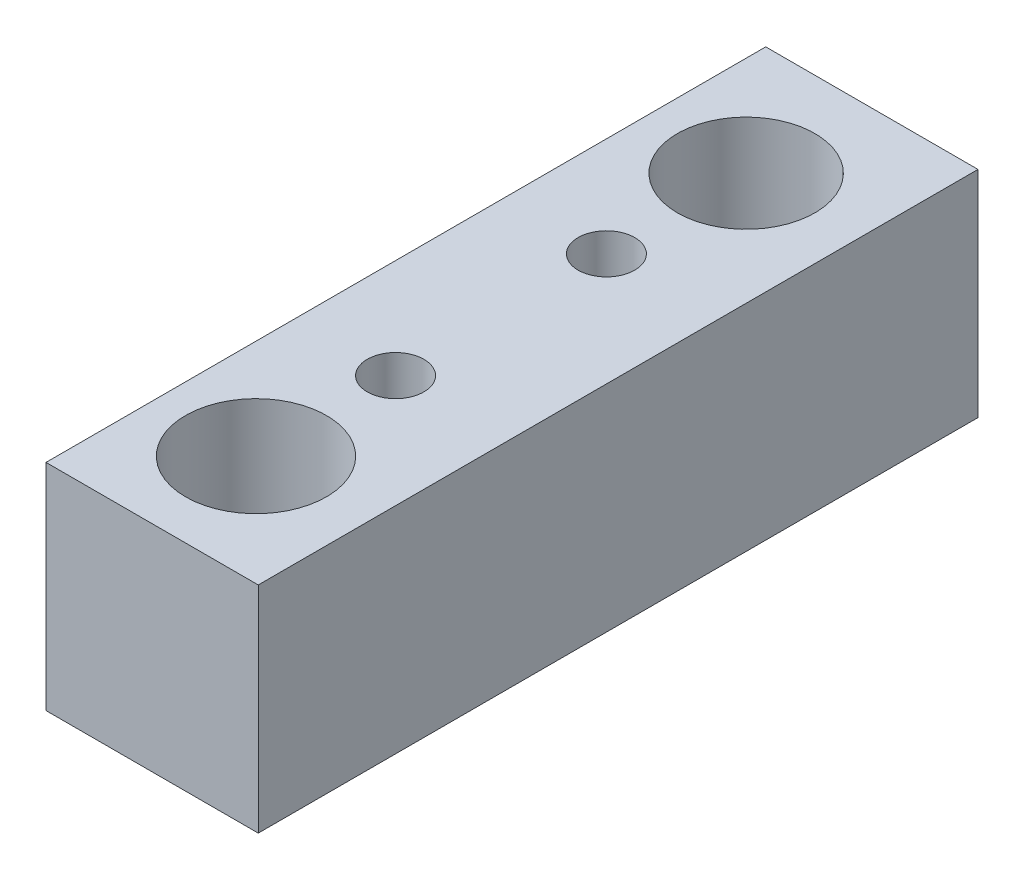
ISO-10303-21;
HEADER;
FILE_DESCRIPTION(('STEP AP214'),'2;1');
FILE_NAME('part.step','',(''),(''),'','','');
FILE_SCHEMA(('AUTOMOTIVE_DESIGN { 1 0 10303 214 1 1 1 1 }'));
ENDSEC;
DATA;
#1=APPLICATION_CONTEXT('core data for automotive mechanical design processes');
#2=APPLICATION_PROTOCOL_DEFINITION('international standard','automotive_design',2000,#1);
#3=PRODUCT_CONTEXT('',#1,'mechanical');
#4=PRODUCT('Part','Part','',(#3));
#5=PRODUCT_RELATED_PRODUCT_CATEGORY('part','',(#4));
#6=PRODUCT_DEFINITION_FORMATION('','',#4);
#7=PRODUCT_DEFINITION_CONTEXT('part definition',#1,'design');
#8=PRODUCT_DEFINITION('design','',#6,#7);
#9=PRODUCT_DEFINITION_SHAPE('','',#8);
#10=(LENGTH_UNIT() NAMED_UNIT(*) SI_UNIT(.MILLI.,.METRE.));
#11=(NAMED_UNIT(*) PLANE_ANGLE_UNIT() SI_UNIT($,.RADIAN.));
#12=(NAMED_UNIT(*) SI_UNIT($,.STERADIAN.) SOLID_ANGLE_UNIT());
#13=UNCERTAINTY_MEASURE_WITH_UNIT(LENGTH_MEASURE(1.E-05),#10,'distance_accuracy_value','');
#14=(GEOMETRIC_REPRESENTATION_CONTEXT(3) GLOBAL_UNCERTAINTY_ASSIGNED_CONTEXT((#13)) GLOBAL_UNIT_ASSIGNED_CONTEXT((#10,
#11,#12)) REPRESENTATION_CONTEXT('',''));
#15=CARTESIAN_POINT('',(0.,0.,0.));
#16=DIRECTION('',(0.,0.,1.));
#17=DIRECTION('',(1.,0.,0.));
#18=AXIS2_PLACEMENT_3D('',#15,#16,#17);
#19=CARTESIAN_POINT('',(60.,28.4200909691457,101.920326234178));
#20=DIRECTION('',(0.,0.,-1.));
#21=DIRECTION('',(-1.,0.,0.));
#22=AXIS2_PLACEMENT_3D('',#19,#20,#21);
#23=PLANE('',#22);
#24=DIRECTION('',(0.,-1.,0.));
#25=VECTOR('',#24,1.);
#26=CARTESIAN_POINT('',(0.,28.4200909691457,101.920326234178));
#27=LINE('',#26,#25);
#28=CARTESIAN_POINT('',(0.,28.4200909691457,101.920326234178));
#29=VERTEX_POINT('',#28);
#30=CARTESIAN_POINT('',(0.,-32.3401035166141,101.920326234178));
#31=VERTEX_POINT('',#30);
#32=EDGE_CURVE('E96',#29,#31,#27,.T.);
#33=ORIENTED_EDGE('',*,*,#32,.T.);
#34=DIRECTION('',(-1.,0.,0.));
#35=VECTOR('',#34,1.);
#36=CARTESIAN_POINT('',(60.,-32.3401035166141,101.920326234178));
#37=LINE('',#36,#35);
#38=CARTESIAN_POINT('',(60.,-32.3401035166141,101.920326234178));
#39=VERTEX_POINT('',#38);
#40=EDGE_CURVE('E11',#39,#31,#37,.T.);
#41=ORIENTED_EDGE('',*,*,#40,.F.);
#42=DIRECTION('',(0.,-1.,0.));
#43=VECTOR('',#42,1.);
#44=CARTESIAN_POINT('',(60.,28.4200909691457,101.920326234178));
#45=LINE('',#44,#43);
#46=CARTESIAN_POINT('',(60.,28.4200909691457,101.920326234178));
#47=VERTEX_POINT('',#46);
#48=EDGE_CURVE('E84',#47,#39,#45,.T.);
#49=ORIENTED_EDGE('',*,*,#48,.F.);
#50=DIRECTION('',(-1.,0.,0.));
#51=VECTOR('',#50,1.);
#52=CARTESIAN_POINT('',(60.,28.4200909691457,101.920326234178));
#53=LINE('',#52,#51);
#54=EDGE_CURVE('E92',#47,#29,#53,.T.);
#55=ORIENTED_EDGE('',*,*,#54,.T.);
#56=EDGE_LOOP('',(#33,#41,#49,#55));
#57=FACE_BOUND('',#56,.T.);
#58=ADVANCED_FACE('F33',(#57),#23,.F.);
#59=CARTESIAN_POINT('',(60.,-32.3401035166141,101.920326234178));
#60=DIRECTION('',(0.,1.,0.));
#61=DIRECTION('',(0.,0.,1.));
#62=AXIS2_PLACEMENT_3D('',#59,#60,#61);
#63=PLANE('',#62);
#64=CARTESIAN_POINT('',(28.1574756542223,-32.3401035166141,70.7138110485273));
#65=DIRECTION('',(0.,1.,0.));
#66=DIRECTION('',(0.,0.,1.));
#67=AXIS2_PLACEMENT_3D('',#64,#65,#66);
#68=CIRCLE('',#67,19.923805807868);
#69=CARTESIAN_POINT('',(28.1574756542223,-32.3401035166141,90.6376168563953));
#70=VERTEX_POINT('',#69);
#71=EDGE_CURVE('E115',#70,#70,#68,.T.);
#72=ORIENTED_EDGE('',*,*,#71,.T.);
#73=EDGE_LOOP('',(#72));
#74=FACE_BOUND('',#73,.T.);
#75=CARTESIAN_POINT('',(28.1574756542223,-32.3401035166141,-67.8353457125255));
#76=DIRECTION('',(0.,1.,0.));
#77=DIRECTION('',(0.,0.,1.));
#78=AXIS2_PLACEMENT_3D('',#75,#76,#77);
#79=CIRCLE('',#78,19.4344971022291);
#80=CARTESIAN_POINT('',(28.1574756542223,-32.3401035166141,-48.4008486102964));
#81=VERTEX_POINT('',#80);
#82=EDGE_CURVE('E99',#81,#81,#79,.T.);
#83=ORIENTED_EDGE('',*,*,#82,.T.);
#84=EDGE_LOOP('',(#83));
#85=FACE_BOUND('',#84,.T.);
#86=DIRECTION('',(0.,0.,-1.));
#87=VECTOR('',#86,1.);
#88=CARTESIAN_POINT('',(0.,-32.3401035166141,101.920326234178));
#89=LINE('',#88,#87);
#90=CARTESIAN_POINT('',(0.,-32.3401035166141,-101.528324979431));
#91=VERTEX_POINT('',#90);
#92=EDGE_CURVE('E88',#31,#91,#89,.T.);
#93=ORIENTED_EDGE('',*,*,#92,.T.);
#94=DIRECTION('',(-1.,0.,0.));
#95=VECTOR('',#94,1.);
#96=CARTESIAN_POINT('',(60.,-32.3401035166141,-101.528324979431));
#97=LINE('',#96,#95);
#98=CARTESIAN_POINT('',(60.,-32.3401035166141,-101.528324979431));
#99=VERTEX_POINT('',#98);
#100=EDGE_CURVE('E41',#99,#91,#97,.T.);
#101=ORIENTED_EDGE('',*,*,#100,.F.);
#102=DIRECTION('',(0.,0.,-1.));
#103=VECTOR('',#102,1.);
#104=CARTESIAN_POINT('',(60.,-32.3401035166141,101.920326234178));
#105=LINE('',#104,#103);
#106=EDGE_CURVE('E79',#39,#99,#105,.T.);
#107=ORIENTED_EDGE('',*,*,#106,.F.);
#108=ORIENTED_EDGE('',*,*,#40,.T.);
#109=EDGE_LOOP('',(#93,#101,#107,#108));
#110=FACE_BOUND('',#109,.T.);
#111=ADVANCED_FACE('F87',(#74,#85,#110),#63,.F.);
#112=CARTESIAN_POINT('',(60.,28.4200909691457,-101.528324979431));
#113=DIRECTION('',(0.,0.,1.));
#114=DIRECTION('',(1.,0.,0.));
#115=AXIS2_PLACEMENT_3D('',#112,#113,#114);
#116=PLANE('',#115);
#117=DIRECTION('',(0.,1.,0.));
#118=VECTOR('',#117,1.);
#119=CARTESIAN_POINT('',(0.,28.4200909691457,-101.528324979431));
#120=LINE('',#119,#118);
#121=CARTESIAN_POINT('',(0.,28.4200909691457,-101.528324979431));
#122=VERTEX_POINT('',#121);
#123=EDGE_CURVE('E66',#91,#122,#120,.T.);
#124=ORIENTED_EDGE('',*,*,#123,.T.);
#125=DIRECTION('',(-1.,0.,0.));
#126=VECTOR('',#125,1.);
#127=CARTESIAN_POINT('',(60.,28.4200909691457,-101.528324979431));
#128=LINE('',#127,#126);
#129=CARTESIAN_POINT('',(60.,28.4200909691457,-101.528324979431));
#130=VERTEX_POINT('',#129);
#131=EDGE_CURVE('E89',#130,#122,#128,.T.);
#132=ORIENTED_EDGE('',*,*,#131,.F.);
#133=DIRECTION('',(0.,1.,0.));
#134=VECTOR('',#133,1.);
#135=CARTESIAN_POINT('',(60.,28.4200909691457,-101.528324979431));
#136=LINE('',#135,#134);
#137=EDGE_CURVE('E82',#99,#130,#136,.T.);
#138=ORIENTED_EDGE('',*,*,#137,.F.);
#139=ORIENTED_EDGE('',*,*,#100,.T.);
#140=EDGE_LOOP('',(#124,#132,#138,#139));
#141=FACE_BOUND('',#140,.T.);
#142=ADVANCED_FACE('F90',(#141),#116,.F.);
#143=CARTESIAN_POINT('',(60.,28.4200909691457,101.920326234178));
#144=DIRECTION('',(0.,-1.,0.));
#145=DIRECTION('',(0.,0.,-1.));
#146=AXIS2_PLACEMENT_3D('',#143,#144,#145);
#147=PLANE('',#146);
#148=CARTESIAN_POINT('',(28.1574756542223,28.4200909691457,31.2660703596712));
#149=DIRECTION('',(0.,1.,0.));
#150=DIRECTION('',(0.,0.,1.));
#151=AXIS2_PLACEMENT_3D('',#148,#149,#150);
#152=CIRCLE('',#151,8.);
#153=CARTESIAN_POINT('',(28.1574756542223,28.4200909691457,39.2660703596712));
#154=VERTEX_POINT('',#153);
#155=EDGE_CURVE('E128',#154,#154,#152,.T.);
#156=ORIENTED_EDGE('',*,*,#155,.F.);
#157=EDGE_LOOP('',(#156));
#158=FACE_BOUND('',#157,.T.);
#159=CARTESIAN_POINT('',(28.1574756542223,28.4200909691457,-28.339432246705));
#160=DIRECTION('',(0.,1.,0.));
#161=DIRECTION('',(0.,0.,1.));
#162=AXIS2_PLACEMENT_3D('',#159,#160,#161);
#163=CIRCLE('',#162,8.);
#164=CARTESIAN_POINT('',(28.1574756542223,28.4200909691457,-20.339432246705));
#165=VERTEX_POINT('',#164);
#166=EDGE_CURVE('E122',#165,#165,#163,.T.);
#167=ORIENTED_EDGE('',*,*,#166,.F.);
#168=EDGE_LOOP('',(#167));
#169=FACE_BOUND('',#168,.T.);
#170=CARTESIAN_POINT('',(28.1574756542223,28.4200909691457,70.7138110485273));
#171=DIRECTION('',(0.,1.,0.));
#172=DIRECTION('',(0.,0.,1.));
#173=AXIS2_PLACEMENT_3D('',#170,#171,#172);
#174=CIRCLE('',#173,19.923805807868);
#175=CARTESIAN_POINT('',(28.1574756542223,28.4200909691457,90.6376168563953));
#176=VERTEX_POINT('',#175);
#177=EDGE_CURVE('E118',#176,#176,#174,.T.);
#178=ORIENTED_EDGE('',*,*,#177,.F.);
#179=EDGE_LOOP('',(#178));
#180=FACE_BOUND('',#179,.T.);
#181=CARTESIAN_POINT('',(28.1574756542223,28.4200909691457,-67.8353457125255));
#182=DIRECTION('',(0.,1.,0.));
#183=DIRECTION('',(0.,0.,1.));
#184=AXIS2_PLACEMENT_3D('',#181,#182,#183);
#185=CIRCLE('',#184,19.4344971022291);
#186=CARTESIAN_POINT('',(28.1574756542223,28.4200909691457,-48.4008486102964));
#187=VERTEX_POINT('',#186);
#188=EDGE_CURVE('E112',#187,#187,#185,.T.);
#189=ORIENTED_EDGE('',*,*,#188,.F.);
#190=EDGE_LOOP('',(#189));
#191=FACE_BOUND('',#190,.T.);
#192=DIRECTION('',(0.,0.,1.));
#193=VECTOR('',#192,1.);
#194=CARTESIAN_POINT('',(0.,28.4200909691457,101.920326234178));
#195=LINE('',#194,#193);
#196=EDGE_CURVE('E72',#122,#29,#195,.T.);
#197=ORIENTED_EDGE('',*,*,#196,.T.);
#198=ORIENTED_EDGE('',*,*,#54,.F.);
#199=DIRECTION('',(0.,0.,1.));
#200=VECTOR('',#199,1.);
#201=CARTESIAN_POINT('',(60.,28.4200909691457,101.920326234178));
#202=LINE('',#201,#200);
#203=EDGE_CURVE('E49',#130,#47,#202,.T.);
#204=ORIENTED_EDGE('',*,*,#203,.F.);
#205=ORIENTED_EDGE('',*,*,#131,.T.);
#206=EDGE_LOOP('',(#197,#198,#204,#205));
#207=FACE_BOUND('',#206,.T.);
#208=ADVANCED_FACE('F104',(#158,#169,#180,#191,#207),#147,.F.);
#209=CARTESIAN_POINT('',(60.,-32.3401035166141,101.920326234178));
#210=DIRECTION('',(1.,0.,0.));
#211=DIRECTION('',(0.,0.,-1.));
#212=AXIS2_PLACEMENT_3D('',#209,#210,#211);
#213=PLANE('',#212);
#214=ORIENTED_EDGE('',*,*,#48,.T.);
#215=ORIENTED_EDGE('',*,*,#106,.T.);
#216=ORIENTED_EDGE('',*,*,#137,.T.);
#217=ORIENTED_EDGE('',*,*,#203,.T.);
#218=EDGE_LOOP('',(#214,#215,#216,#217));
#219=FACE_BOUND('',#218,.T.);
#220=ADVANCED_FACE('F80',(#219),#213,.T.);
#221=CARTESIAN_POINT('',(0.,-32.3401035166141,101.920326234178));
#222=DIRECTION('',(1.,0.,0.));
#223=DIRECTION('',(0.,0.,-1.));
#224=AXIS2_PLACEMENT_3D('',#221,#222,#223);
#225=PLANE('',#224);
#226=ORIENTED_EDGE('',*,*,#32,.F.);
#227=ORIENTED_EDGE('',*,*,#196,.F.);
#228=ORIENTED_EDGE('',*,*,#123,.F.);
#229=ORIENTED_EDGE('',*,*,#92,.F.);
#230=EDGE_LOOP('',(#226,#227,#228,#229));
#231=FACE_BOUND('',#230,.T.);
#232=ADVANCED_FACE('F107',(#231),#225,.F.);
#233=CARTESIAN_POINT('',(28.1574756542223,-51.5799090308543,-67.8353457125255));
#234=DIRECTION('',(0.,1.,0.));
#235=DIRECTION('',(0.,0.,1.));
#236=AXIS2_PLACEMENT_3D('',#233,#234,#235);
#237=CYLINDRICAL_SURFACE('',#236,19.4344971022291);
#238=ORIENTED_EDGE('',*,*,#188,.T.);
#239=EDGE_LOOP('',(#238));
#240=FACE_BOUND('',#239,.T.);
#241=ORIENTED_EDGE('',*,*,#82,.F.);
#242=EDGE_LOOP('',(#241));
#243=FACE_BOUND('',#242,.T.);
#244=ADVANCED_FACE('F152',(#240,#243),#237,.F.);
#245=CARTESIAN_POINT('',(28.1574756542223,-51.5799090308543,70.7138110485273));
#246=DIRECTION('',(0.,1.,0.));
#247=DIRECTION('',(0.,0.,1.));
#248=AXIS2_PLACEMENT_3D('',#245,#246,#247);
#249=CYLINDRICAL_SURFACE('',#248,19.923805807868);
#250=ORIENTED_EDGE('',*,*,#177,.T.);
#251=EDGE_LOOP('',(#250));
#252=FACE_BOUND('',#251,.T.);
#253=ORIENTED_EDGE('',*,*,#71,.F.);
#254=EDGE_LOOP('',(#253));
#255=FACE_BOUND('',#254,.T.);
#256=ADVANCED_FACE('F155',(#252,#255),#249,.F.);
#257=CARTESIAN_POINT('',(28.1574756542223,-16.5799090308543,-28.339432246705));
#258=DIRECTION('',(0.,1.,0.));
#259=DIRECTION('',(0.,0.,1.));
#260=AXIS2_PLACEMENT_3D('',#257,#258,#259);
#261=CYLINDRICAL_SURFACE('',#260,8.);
#262=CARTESIAN_POINT('',(28.1574756542223,-16.5799090308543,-28.339432246705));
#263=DIRECTION('',(0.,1.,0.));
#264=DIRECTION('',(0.,0.,1.));
#265=AXIS2_PLACEMENT_3D('',#262,#263,#264);
#266=CIRCLE('',#265,8.);
#267=CARTESIAN_POINT('',(28.1574756542223,-16.5799090308543,-20.339432246705));
#268=VERTEX_POINT('',#267);
#269=EDGE_CURVE('E121',#268,#268,#266,.T.);
#270=ORIENTED_EDGE('',*,*,#269,.F.);
#271=EDGE_LOOP('',(#270));
#272=FACE_BOUND('',#271,.T.);
#273=ORIENTED_EDGE('',*,*,#166,.T.);
#274=EDGE_LOOP('',(#273));
#275=FACE_BOUND('',#274,.T.);
#276=ADVANCED_FACE('F173',(#272,#275),#261,.F.);
#277=CARTESIAN_POINT('',(28.1574756542223,-16.5799090308543,-28.339432246705));
#278=DIRECTION('',(0.,1.,0.));
#279=DIRECTION('',(0.,0.,1.));
#280=AXIS2_PLACEMENT_3D('',#277,#278,#279);
#281=PLANE('',#280);
#282=ORIENTED_EDGE('',*,*,#269,.T.);
#283=EDGE_LOOP('',(#282));
#284=FACE_BOUND('',#283,.T.);
#285=ADVANCED_FACE('F139',(#284),#281,.T.);
#286=CARTESIAN_POINT('',(28.1574756542223,-16.5799090308543,31.2660703596712));
#287=DIRECTION('',(0.,1.,0.));
#288=DIRECTION('',(0.,0.,1.));
#289=AXIS2_PLACEMENT_3D('',#286,#287,#288);
#290=CYLINDRICAL_SURFACE('',#289,8.);
#291=CARTESIAN_POINT('',(28.1574756542223,-16.5799090308543,31.2660703596712));
#292=DIRECTION('',(0.,1.,0.));
#293=DIRECTION('',(0.,0.,1.));
#294=AXIS2_PLACEMENT_3D('',#291,#292,#293);
#295=CIRCLE('',#294,8.);
#296=CARTESIAN_POINT('',(28.1574756542223,-16.5799090308543,39.2660703596712));
#297=VERTEX_POINT('',#296);
#298=EDGE_CURVE('E125',#297,#297,#295,.T.);
#299=ORIENTED_EDGE('',*,*,#298,.F.);
#300=EDGE_LOOP('',(#299));
#301=FACE_BOUND('',#300,.T.);
#302=ORIENTED_EDGE('',*,*,#155,.T.);
#303=EDGE_LOOP('',(#302));
#304=FACE_BOUND('',#303,.T.);
#305=ADVANCED_FACE('F136',(#301,#304),#290,.F.);
#306=CARTESIAN_POINT('',(28.1574756542223,-16.5799090308543,31.2660703596712));
#307=DIRECTION('',(0.,1.,0.));
#308=DIRECTION('',(0.,0.,1.));
#309=AXIS2_PLACEMENT_3D('',#306,#307,#308);
#310=PLANE('',#309);
#311=ORIENTED_EDGE('',*,*,#298,.T.);
#312=EDGE_LOOP('',(#311));
#313=FACE_BOUND('',#312,.T.);
#314=ADVANCED_FACE('F134',(#313),#310,.T.);
#315=CLOSED_SHELL('',(#58,#111,#142,#208,#220,#232,#244,#256,#276,#285,#305,#314));
#316=MANIFOLD_SOLID_BREP('B2',#315);
#317=ADVANCED_BREP_SHAPE_REPRESENTATION('',(#18,#316),#14);
#318=SHAPE_DEFINITION_REPRESENTATION(#9,#317);
ENDSEC;
END-ISO-10303-21;
